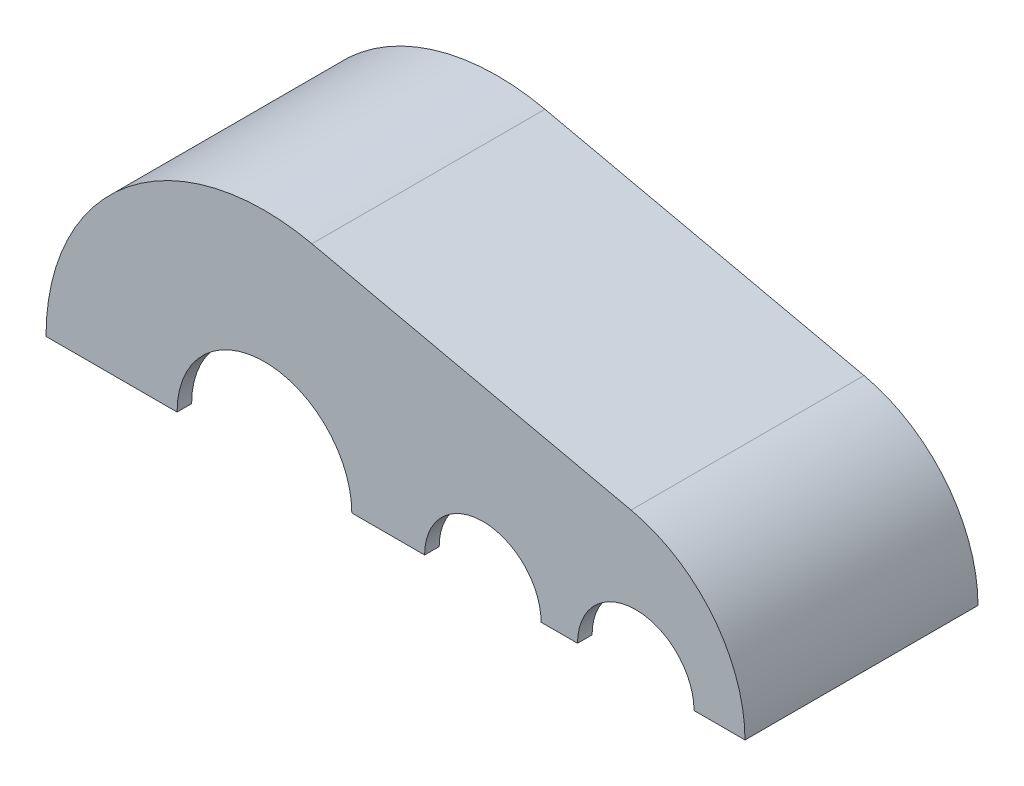
ISO-10303-21;
HEADER;
FILE_DESCRIPTION(('STEP AP214'),'2;1');
FILE_NAME('part.step','',(''),(''),'','','');
FILE_SCHEMA(('AUTOMOTIVE_DESIGN { 1 0 10303 214 1 1 1 1 }'));
ENDSEC;
DATA;
#1=APPLICATION_CONTEXT('core data for automotive mechanical design processes');
#2=APPLICATION_PROTOCOL_DEFINITION('international standard','automotive_design',2000,#1);
#3=PRODUCT_CONTEXT('',#1,'mechanical');
#4=PRODUCT('Part','Part','',(#3));
#5=PRODUCT_RELATED_PRODUCT_CATEGORY('part','',(#4));
#6=PRODUCT_DEFINITION_FORMATION('','',#4);
#7=PRODUCT_DEFINITION_CONTEXT('part definition',#1,'design');
#8=PRODUCT_DEFINITION('design','',#6,#7);
#9=PRODUCT_DEFINITION_SHAPE('','',#8);
#10=(LENGTH_UNIT() NAMED_UNIT(*) SI_UNIT(.MILLI.,.METRE.));
#11=(NAMED_UNIT(*) PLANE_ANGLE_UNIT() SI_UNIT($,.RADIAN.));
#12=(NAMED_UNIT(*) SI_UNIT($,.STERADIAN.) SOLID_ANGLE_UNIT());
#13=UNCERTAINTY_MEASURE_WITH_UNIT(LENGTH_MEASURE(1.E-05),#10,'distance_accuracy_value','');
#14=(GEOMETRIC_REPRESENTATION_CONTEXT(3) GLOBAL_UNCERTAINTY_ASSIGNED_CONTEXT((#13)) GLOBAL_UNIT_ASSIGNED_CONTEXT((#10,
#11,#12)) REPRESENTATION_CONTEXT('',''));
#15=CARTESIAN_POINT('',(0.,0.,0.));
#16=DIRECTION('',(0.,0.,1.));
#17=DIRECTION('',(1.,0.,0.));
#18=AXIS2_PLACEMENT_3D('',#15,#16,#17);
#19=CARTESIAN_POINT('',(0.,0.,0.));
#20=DIRECTION('',(0.,-1.,0.));
#21=DIRECTION('',(0.,0.,-1.));
#22=AXIS2_PLACEMENT_3D('',#19,#20,#21);
#23=PLANE('',#22);
#24=DIRECTION('',(0.,0.,1.));
#25=VECTOR('',#24,1.);
#26=CARTESIAN_POINT('',(20.,0.,-80.));
#27=LINE('',#26,#25);
#28=CARTESIAN_POINT('',(20.,0.,-70.));
#29=VERTEX_POINT('',#28);
#30=CARTESIAN_POINT('',(20.,0.,-80.));
#31=VERTEX_POINT('',#30);
#32=EDGE_CURVE('E309',#29,#31,#27,.F.);
#33=ORIENTED_EDGE('',*,*,#32,.F.);
#34=DIRECTION('',(-1.,0.,0.));
#35=VECTOR('',#34,1.);
#36=CARTESIAN_POINT('',(0.,0.,-70.));
#37=LINE('',#36,#35);
#38=CARTESIAN_POINT('',(-30.,0.,-70.));
#39=VERTEX_POINT('',#38);
#40=EDGE_CURVE('E214',#29,#39,#37,.T.);
#41=ORIENTED_EDGE('',*,*,#40,.T.);
#42=DIRECTION('',(0.,0.,1.));
#43=VECTOR('',#42,1.);
#44=CARTESIAN_POINT('',(-30.,0.,-80.));
#45=LINE('',#44,#43);
#46=CARTESIAN_POINT('',(-30.,0.,-80.));
#47=VERTEX_POINT('',#46);
#48=EDGE_CURVE('E12',#47,#39,#45,.T.);
#49=ORIENTED_EDGE('',*,*,#48,.F.);
#50=DIRECTION('',(-1.,0.,0.));
#51=VECTOR('',#50,1.);
#52=CARTESIAN_POINT('',(-240.,0.,-80.));
#53=LINE('',#52,#51);
#54=EDGE_CURVE('E332',#31,#47,#53,.T.);
#55=ORIENTED_EDGE('',*,*,#54,.F.);
#56=EDGE_LOOP('',(#33,#41,#49,#55));
#57=FACE_BOUND('',#56,.T.);
#58=ADVANCED_FACE('F43',(#57),#23,.T.);
#59=CARTESIAN_POINT('',(-30.,0.,70.));
#60=VERTEX_POINT('',#59);
#61=CARTESIAN_POINT('',(-30.,0.,80.));
#62=VERTEX_POINT('',#61);
#63=EDGE_CURVE('E51',#60,#62,#45,.T.);
#64=ORIENTED_EDGE('',*,*,#63,.F.);
#65=DIRECTION('',(1.,0.,0.));
#66=VECTOR('',#65,1.);
#67=CARTESIAN_POINT('',(0.,0.,70.));
#68=LINE('',#67,#66);
#69=CARTESIAN_POINT('',(20.,0.,70.));
#70=VERTEX_POINT('',#69);
#71=EDGE_CURVE('E240',#60,#70,#68,.T.);
#72=ORIENTED_EDGE('',*,*,#71,.T.);
#73=CARTESIAN_POINT('',(19.9999999999999,0.,80.));
#74=VERTEX_POINT('',#73);
#75=EDGE_CURVE('E310',#74,#70,#27,.F.);
#76=ORIENTED_EDGE('',*,*,#75,.F.);
#77=DIRECTION('',(1.,0.,0.));
#78=VECTOR('',#77,1.);
#79=CARTESIAN_POINT('',(-240.,0.,80.));
#80=LINE('',#79,#78);
#81=EDGE_CURVE('E302',#62,#74,#80,.T.);
#82=ORIENTED_EDGE('',*,*,#81,.F.);
#83=EDGE_LOOP('',(#64,#72,#76,#82));
#84=FACE_BOUND('',#83,.T.);
#85=ADVANCED_FACE('F373',(#84),#23,.T.);
#86=DIRECTION('',(0.,0.,1.));
#87=VECTOR('',#86,1.);
#88=CARTESIAN_POINT('',(125.,0.,-80.));
#89=LINE('',#88,#87);
#90=CARTESIAN_POINT('',(125.,0.,-70.));
#91=VERTEX_POINT('',#90);
#92=CARTESIAN_POINT('',(125.,0.,-80.));
#93=VERTEX_POINT('',#92);
#94=EDGE_CURVE('E301',#91,#93,#89,.F.);
#95=ORIENTED_EDGE('',*,*,#94,.F.);
#96=DIRECTION('',(-1.,0.,0.));
#97=VECTOR('',#96,1.);
#98=CARTESIAN_POINT('',(0.,0.,-70.));
#99=LINE('',#98,#97);
#100=CARTESIAN_POINT('',(100.,0.,-70.));
#101=VERTEX_POINT('',#100);
#102=EDGE_CURVE('E217',#91,#101,#99,.T.);
#103=ORIENTED_EDGE('',*,*,#102,.T.);
#104=DIRECTION('',(0.,0.,1.));
#105=VECTOR('',#104,1.);
#106=CARTESIAN_POINT('',(100.,0.,-80.));
#107=LINE('',#106,#105);
#108=CARTESIAN_POINT('',(100.,0.,-80.));
#109=VERTEX_POINT('',#108);
#110=EDGE_CURVE('E314',#109,#101,#107,.T.);
#111=ORIENTED_EDGE('',*,*,#110,.F.);
#112=EDGE_CURVE('E294',#93,#109,#53,.T.);
#113=ORIENTED_EDGE('',*,*,#112,.F.);
#114=EDGE_LOOP('',(#95,#103,#111,#113));
#115=FACE_BOUND('',#114,.T.);
#116=ADVANCED_FACE('F341',(#115),#23,.T.);
#117=CARTESIAN_POINT('',(100.,0.,70.));
#118=VERTEX_POINT('',#117);
#119=CARTESIAN_POINT('',(100.,0.,80.));
#120=VERTEX_POINT('',#119);
#121=EDGE_CURVE('E313',#118,#120,#107,.T.);
#122=ORIENTED_EDGE('',*,*,#121,.F.);
#123=DIRECTION('',(1.,0.,0.));
#124=VECTOR('',#123,1.);
#125=CARTESIAN_POINT('',(0.,0.,70.));
#126=LINE('',#125,#124);
#127=CARTESIAN_POINT('',(125.,0.,70.));
#128=VERTEX_POINT('',#127);
#129=EDGE_CURVE('E236',#118,#128,#126,.T.);
#130=ORIENTED_EDGE('',*,*,#129,.T.);
#131=CARTESIAN_POINT('',(125.,0.,80.));
#132=VERTEX_POINT('',#131);
#133=EDGE_CURVE('E303',#132,#128,#89,.F.);
#134=ORIENTED_EDGE('',*,*,#133,.F.);
#135=EDGE_CURVE('E362',#120,#132,#80,.T.);
#136=ORIENTED_EDGE('',*,*,#135,.F.);
#137=EDGE_LOOP('',(#122,#130,#134,#136));
#138=FACE_BOUND('',#137,.T.);
#139=ADVANCED_FACE('F379',(#138),#23,.T.);
#140=DIRECTION('',(0.,0.,1.));
#141=VECTOR('',#140,1.);
#142=CARTESIAN_POINT('',(230.,0.,70.));
#143=LINE('',#142,#141);
#144=CARTESIAN_POINT('',(230.,0.,70.));
#145=VERTEX_POINT('',#144);
#146=CARTESIAN_POINT('',(230.,0.,-70.));
#147=VERTEX_POINT('',#146);
#148=EDGE_CURVE('E190',#145,#147,#143,.F.);
#149=ORIENTED_EDGE('',*,*,#148,.T.);
#150=DIRECTION('',(-1.,0.,0.));
#151=VECTOR('',#150,1.);
#152=CARTESIAN_POINT('',(0.,0.,-70.));
#153=LINE('',#152,#151);
#154=CARTESIAN_POINT('',(205.,0.,-70.));
#155=VERTEX_POINT('',#154);
#156=EDGE_CURVE('E225',#147,#155,#153,.T.);
#157=ORIENTED_EDGE('',*,*,#156,.T.);
#158=DIRECTION('',(0.,0.,1.));
#159=VECTOR('',#158,1.);
#160=CARTESIAN_POINT('',(205.,0.,-80.));
#161=LINE('',#160,#159);
#162=CARTESIAN_POINT('',(205.,0.,-80.));
#163=VERTEX_POINT('',#162);
#164=EDGE_CURVE('E306',#163,#155,#161,.T.);
#165=ORIENTED_EDGE('',*,*,#164,.F.);
#166=CARTESIAN_POINT('',(240.,0.,-80.));
#167=VERTEX_POINT('',#166);
#168=EDGE_CURVE('E290',#167,#163,#53,.T.);
#169=ORIENTED_EDGE('',*,*,#168,.F.);
#170=DIRECTION('',(0.,0.,-1.));
#171=VECTOR('',#170,1.);
#172=CARTESIAN_POINT('',(240.,0.,80.));
#173=LINE('',#172,#171);
#174=CARTESIAN_POINT('',(240.,0.,80.));
#175=VERTEX_POINT('',#174);
#176=EDGE_CURVE('E286',#175,#167,#173,.T.);
#177=ORIENTED_EDGE('',*,*,#176,.F.);
#178=CARTESIAN_POINT('',(205.,0.,80.));
#179=VERTEX_POINT('',#178);
#180=EDGE_CURVE('E297',#179,#175,#80,.T.);
#181=ORIENTED_EDGE('',*,*,#180,.F.);
#182=CARTESIAN_POINT('',(205.,0.,70.));
#183=VERTEX_POINT('',#182);
#184=EDGE_CURVE('E305',#183,#179,#161,.T.);
#185=ORIENTED_EDGE('',*,*,#184,.F.);
#186=DIRECTION('',(1.,0.,0.));
#187=VECTOR('',#186,1.);
#188=CARTESIAN_POINT('',(0.,0.,70.));
#189=LINE('',#188,#187);
#190=EDGE_CURVE('E233',#183,#145,#189,.T.);
#191=ORIENTED_EDGE('',*,*,#190,.T.);
#192=EDGE_LOOP('',(#149,#157,#165,#169,#177,#181,#185,#191));
#193=FACE_BOUND('',#192,.T.);
#194=ADVANCED_FACE('F351',(#193),#23,.T.);
#195=DIRECTION('',(0.,0.,1.));
#196=VECTOR('',#195,1.);
#197=CARTESIAN_POINT('',(-230.,0.,-70.));
#198=LINE('',#197,#196);
#199=CARTESIAN_POINT('',(-230.,0.,-70.));
#200=VERTEX_POINT('',#199);
#201=CARTESIAN_POINT('',(-230.,0.,70.));
#202=VERTEX_POINT('',#201);
#203=EDGE_CURVE('E202',#200,#202,#198,.T.);
#204=ORIENTED_EDGE('',*,*,#203,.T.);
#205=DIRECTION('',(1.,0.,0.));
#206=VECTOR('',#205,1.);
#207=CARTESIAN_POINT('',(0.,0.,70.));
#208=LINE('',#207,#206);
#209=CARTESIAN_POINT('',(-150.,0.,70.));
#210=VERTEX_POINT('',#209);
#211=EDGE_CURVE('E245',#202,#210,#208,.T.);
#212=ORIENTED_EDGE('',*,*,#211,.T.);
#213=DIRECTION('',(0.,0.,1.));
#214=VECTOR('',#213,1.);
#215=CARTESIAN_POINT('',(-150.,0.,-80.));
#216=LINE('',#215,#214);
#217=CARTESIAN_POINT('',(-150.,0.,80.));
#218=VERTEX_POINT('',#217);
#219=EDGE_CURVE('E317',#218,#210,#216,.F.);
#220=ORIENTED_EDGE('',*,*,#219,.F.);
#221=CARTESIAN_POINT('',(-240.,0.,80.));
#222=VERTEX_POINT('',#221);
#223=EDGE_CURVE('E298',#222,#218,#80,.T.);
#224=ORIENTED_EDGE('',*,*,#223,.F.);
#225=DIRECTION('',(0.,0.,1.));
#226=VECTOR('',#225,1.);
#227=CARTESIAN_POINT('',(-240.,0.,80.));
#228=LINE('',#227,#226);
#229=CARTESIAN_POINT('',(-240.,0.,-80.));
#230=VERTEX_POINT('',#229);
#231=EDGE_CURVE('E293',#230,#222,#228,.T.);
#232=ORIENTED_EDGE('',*,*,#231,.F.);
#233=CARTESIAN_POINT('',(-150.,0.,-80.));
#234=VERTEX_POINT('',#233);
#235=EDGE_CURVE('E289',#234,#230,#53,.T.);
#236=ORIENTED_EDGE('',*,*,#235,.F.);
#237=CARTESIAN_POINT('',(-150.,0.,-70.));
#238=VERTEX_POINT('',#237);
#239=EDGE_CURVE('E316',#238,#234,#216,.F.);
#240=ORIENTED_EDGE('',*,*,#239,.F.);
#241=DIRECTION('',(-1.,0.,0.));
#242=VECTOR('',#241,1.);
#243=CARTESIAN_POINT('',(0.,0.,-70.));
#244=LINE('',#243,#242);
#245=EDGE_CURVE('E58',#238,#200,#244,.T.);
#246=ORIENTED_EDGE('',*,*,#245,.T.);
#247=EDGE_LOOP('',(#204,#212,#220,#224,#232,#236,#240,#246));
#248=FACE_BOUND('',#247,.T.);
#249=ADVANCED_FACE('F334',(#248),#23,.T.);
#250=CARTESIAN_POINT('',(165.,0.,-80.));
#251=DIRECTION('',(0.,0.,1.));
#252=DIRECTION('',(1.,0.,0.));
#253=AXIS2_PLACEMENT_3D('',#250,#251,#252);
#254=CYLINDRICAL_SURFACE('',#253,40.);
#255=CARTESIAN_POINT('',(165.,0.,70.));
#256=DIRECTION('',(0.,0.,-1.));
#257=DIRECTION('',(-1.,0.,0.));
#258=AXIS2_PLACEMENT_3D('',#255,#256,#257);
#259=CIRCLE('',#258,40.);
#260=EDGE_CURVE('E222',#183,#128,#259,.F.);
#261=ORIENTED_EDGE('',*,*,#260,.F.);
#262=ORIENTED_EDGE('',*,*,#184,.T.);
#263=CARTESIAN_POINT('',(165.,0.,80.));
#264=DIRECTION('',(0.,0.,1.));
#265=DIRECTION('',(1.,0.,0.));
#266=AXIS2_PLACEMENT_3D('',#263,#264,#265);
#267=CIRCLE('',#266,40.);
#268=EDGE_CURVE('E66',#179,#132,#267,.T.);
#269=ORIENTED_EDGE('',*,*,#268,.T.);
#270=ORIENTED_EDGE('',*,*,#133,.T.);
#271=EDGE_LOOP('',(#261,#262,#269,#270));
#272=FACE_BOUND('',#271,.T.);
#273=ADVANCED_FACE('F381',(#272),#254,.F.);
#274=CARTESIAN_POINT('',(60.,0.,-80.));
#275=DIRECTION('',(0.,0.,1.));
#276=DIRECTION('',(1.,0.,0.));
#277=AXIS2_PLACEMENT_3D('',#274,#275,#276);
#278=CYLINDRICAL_SURFACE('',#277,40.);
#279=CARTESIAN_POINT('',(60.,0.,70.));
#280=DIRECTION('',(0.,0.,-1.));
#281=DIRECTION('',(-1.,0.,0.));
#282=AXIS2_PLACEMENT_3D('',#279,#280,#281);
#283=CIRCLE('',#282,40.);
#284=EDGE_CURVE('E221',#118,#70,#283,.F.);
#285=ORIENTED_EDGE('',*,*,#284,.F.);
#286=ORIENTED_EDGE('',*,*,#121,.T.);
#287=CARTESIAN_POINT('',(60.,0.,80.));
#288=DIRECTION('',(0.,0.,1.));
#289=DIRECTION('',(1.,0.,0.));
#290=AXIS2_PLACEMENT_3D('',#287,#288,#289);
#291=CIRCLE('',#290,40.);
#292=EDGE_CURVE('E256',#120,#74,#291,.T.);
#293=ORIENTED_EDGE('',*,*,#292,.T.);
#294=ORIENTED_EDGE('',*,*,#75,.T.);
#295=EDGE_LOOP('',(#285,#286,#293,#294));
#296=FACE_BOUND('',#295,.T.);
#297=ADVANCED_FACE('F376',(#296),#278,.F.);
#298=CARTESIAN_POINT('',(-90.,0.,-80.));
#299=DIRECTION('',(0.,0.,1.));
#300=DIRECTION('',(1.,0.,0.));
#301=AXIS2_PLACEMENT_3D('',#298,#299,#300);
#302=CYLINDRICAL_SURFACE('',#301,60.);
#303=CARTESIAN_POINT('',(-90.,0.,70.));
#304=DIRECTION('',(0.,0.,-1.));
#305=DIRECTION('',(-1.,0.,0.));
#306=AXIS2_PLACEMENT_3D('',#303,#304,#305);
#307=CIRCLE('',#306,60.);
#308=EDGE_CURVE('E242',#60,#210,#307,.F.);
#309=ORIENTED_EDGE('',*,*,#308,.F.);
#310=ORIENTED_EDGE('',*,*,#63,.T.);
#311=CARTESIAN_POINT('',(-90.,0.,80.));
#312=DIRECTION('',(0.,0.,1.));
#313=DIRECTION('',(1.,0.,0.));
#314=AXIS2_PLACEMENT_3D('',#311,#312,#313);
#315=CIRCLE('',#314,60.);
#316=EDGE_CURVE('E253',#62,#218,#315,.T.);
#317=ORIENTED_EDGE('',*,*,#316,.T.);
#318=ORIENTED_EDGE('',*,*,#219,.T.);
#319=EDGE_LOOP('',(#309,#310,#317,#318));
#320=FACE_BOUND('',#319,.T.);
#321=ADVANCED_FACE('F448',(#320),#302,.F.);
#322=CARTESIAN_POINT('',(-240.,150.,-80.));
#323=DIRECTION('',(0.,0.,1.));
#324=DIRECTION('',(1.,0.,0.));
#325=AXIS2_PLACEMENT_3D('',#322,#323,#324);
#326=PLANE('',#325);
#327=ORIENTED_EDGE('',*,*,#54,.T.);
#328=CARTESIAN_POINT('',(-90.,0.,-80.));
#329=DIRECTION('',(0.,0.,1.));
#330=DIRECTION('',(1.,0.,0.));
#331=AXIS2_PLACEMENT_3D('',#328,#329,#330);
#332=CIRCLE('',#331,60.);
#333=EDGE_CURVE('E255',#47,#234,#332,.T.);
#334=ORIENTED_EDGE('',*,*,#333,.T.);
#335=ORIENTED_EDGE('',*,*,#235,.T.);
#336=CARTESIAN_POINT('',(-90.,0.,-80.));
#337=DIRECTION('',(0.,0.,1.));
#338=DIRECTION('',(1.,0.,0.));
#339=AXIS2_PLACEMENT_3D('',#336,#337,#338);
#340=CIRCLE('',#339,150.);
#341=CARTESIAN_POINT('',(-57.391304347826,146.412680352024,-80.));
#342=VERTEX_POINT('',#341);
#343=EDGE_CURVE('E274',#342,#230,#340,.T.);
#344=ORIENTED_EDGE('',*,*,#343,.F.);
#345=DIRECTION('',(-0.976084535680159,0.217391304347826,0.));
#346=VECTOR('',#345,1.);
#347=CARTESIAN_POINT('',(-57.391304347826,146.412680352024,-80.));
#348=LINE('',#347,#346);
#349=CARTESIAN_POINT('',(161.739130434783,97.6084535680159,-80.));
#350=VERTEX_POINT('',#349);
#351=EDGE_CURVE('E280',#350,#342,#348,.T.);
#352=ORIENTED_EDGE('',*,*,#351,.F.);
#353=CARTESIAN_POINT('',(140.,0.,-80.));
#354=DIRECTION('',(0.,0.,1.));
#355=DIRECTION('',(1.,0.,0.));
#356=AXIS2_PLACEMENT_3D('',#353,#354,#355);
#357=CIRCLE('',#356,100.);
#358=EDGE_CURVE('E277',#167,#350,#357,.T.);
#359=ORIENTED_EDGE('',*,*,#358,.F.);
#360=ORIENTED_EDGE('',*,*,#168,.T.);
#361=CARTESIAN_POINT('',(165.,0.,-80.));
#362=DIRECTION('',(0.,0.,1.));
#363=DIRECTION('',(1.,0.,0.));
#364=AXIS2_PLACEMENT_3D('',#361,#362,#363);
#365=CIRCLE('',#364,40.);
#366=EDGE_CURVE('E249',#163,#93,#365,.T.);
#367=ORIENTED_EDGE('',*,*,#366,.T.);
#368=ORIENTED_EDGE('',*,*,#112,.T.);
#369=CARTESIAN_POINT('',(60.,0.,-80.));
#370=DIRECTION('',(0.,0.,1.));
#371=DIRECTION('',(1.,0.,0.));
#372=AXIS2_PLACEMENT_3D('',#369,#370,#371);
#373=CIRCLE('',#372,40.);
#374=EDGE_CURVE('E260',#109,#31,#373,.T.);
#375=ORIENTED_EDGE('',*,*,#374,.T.);
#376=EDGE_LOOP('',(#327,#334,#335,#344,#352,#359,#360,#367,#368,#375));
#377=FACE_BOUND('',#376,.T.);
#378=ADVANCED_FACE('F45',(#377),#326,.F.);
#379=CARTESIAN_POINT('',(-240.,150.,80.));
#380=DIRECTION('',(0.,0.,-1.));
#381=DIRECTION('',(-1.,0.,0.));
#382=AXIS2_PLACEMENT_3D('',#379,#380,#381);
#383=PLANE('',#382);
#384=ORIENTED_EDGE('',*,*,#223,.T.);
#385=ORIENTED_EDGE('',*,*,#316,.F.);
#386=ORIENTED_EDGE('',*,*,#81,.T.);
#387=ORIENTED_EDGE('',*,*,#292,.F.);
#388=ORIENTED_EDGE('',*,*,#135,.T.);
#389=ORIENTED_EDGE('',*,*,#268,.F.);
#390=ORIENTED_EDGE('',*,*,#180,.T.);
#391=CARTESIAN_POINT('',(140.,0.,80.));
#392=DIRECTION('',(0.,0.,1.));
#393=DIRECTION('',(1.,0.,0.));
#394=AXIS2_PLACEMENT_3D('',#391,#392,#393);
#395=CIRCLE('',#394,100.);
#396=CARTESIAN_POINT('',(161.739130434783,97.6084535680159,80.));
#397=VERTEX_POINT('',#396);
#398=EDGE_CURVE('E268',#175,#397,#395,.T.);
#399=ORIENTED_EDGE('',*,*,#398,.T.);
#400=DIRECTION('',(-0.976084535680159,0.217391304347826,0.));
#401=VECTOR('',#400,1.);
#402=CARTESIAN_POINT('',(-57.391304347826,146.412680352024,80.));
#403=LINE('',#402,#401);
#404=CARTESIAN_POINT('',(-57.391304347826,146.412680352024,80.));
#405=VERTEX_POINT('',#404);
#406=EDGE_CURVE('E271',#397,#405,#403,.T.);
#407=ORIENTED_EDGE('',*,*,#406,.T.);
#408=CARTESIAN_POINT('',(-90.,0.,80.));
#409=DIRECTION('',(0.,0.,1.));
#410=DIRECTION('',(1.,0.,0.));
#411=AXIS2_PLACEMENT_3D('',#408,#409,#410);
#412=CIRCLE('',#411,150.);
#413=EDGE_CURVE('E259',#405,#222,#412,.T.);
#414=ORIENTED_EDGE('',*,*,#413,.T.);
#415=EDGE_LOOP('',(#384,#385,#386,#387,#388,#389,#390,#399,#407,#414));
#416=FACE_BOUND('',#415,.T.);
#417=ADVANCED_FACE('F369',(#416),#383,.F.);
#418=CARTESIAN_POINT('',(-90.,0.,-80.));
#419=DIRECTION('',(0.,0.,1.));
#420=DIRECTION('',(1.,0.,0.));
#421=AXIS2_PLACEMENT_3D('',#418,#419,#420);
#422=CYLINDRICAL_SURFACE('',#421,150.);
#423=ORIENTED_EDGE('',*,*,#343,.T.);
#424=ORIENTED_EDGE('',*,*,#231,.T.);
#425=ORIENTED_EDGE('',*,*,#413,.F.);
#426=DIRECTION('',(0.,0.,1.));
#427=VECTOR('',#426,1.);
#428=CARTESIAN_POINT('',(-57.391304347826,146.412680352024,-80.));
#429=LINE('',#428,#427);
#430=EDGE_CURVE('E284',#342,#405,#429,.T.);
#431=ORIENTED_EDGE('',*,*,#430,.F.);
#432=EDGE_LOOP('',(#423,#424,#425,#431));
#433=FACE_BOUND('',#432,.T.);
#434=ADVANCED_FACE('F390',(#433),#422,.T.);
#435=CARTESIAN_POINT('',(-57.391304347826,146.412680352024,-80.));
#436=DIRECTION('',(0.217391304347826,0.976084535680159,0.));
#437=DIRECTION('',(-0.976084535680159,0.217391304347826,0.));
#438=AXIS2_PLACEMENT_3D('',#435,#436,#437);
#439=PLANE('',#438);
#440=DIRECTION('',(0.,0.,1.));
#441=VECTOR('',#440,1.);
#442=CARTESIAN_POINT('',(161.739130434783,97.6084535680159,-80.));
#443=LINE('',#442,#441);
#444=EDGE_CURVE('E283',#350,#397,#443,.T.);
#445=ORIENTED_EDGE('',*,*,#444,.F.);
#446=ORIENTED_EDGE('',*,*,#351,.T.);
#447=ORIENTED_EDGE('',*,*,#430,.T.);
#448=ORIENTED_EDGE('',*,*,#406,.F.);
#449=EDGE_LOOP('',(#445,#446,#447,#448));
#450=FACE_BOUND('',#449,.T.);
#451=ADVANCED_FACE('F392',(#450),#439,.T.);
#452=CARTESIAN_POINT('',(140.,0.,-80.));
#453=DIRECTION('',(0.,0.,1.));
#454=DIRECTION('',(1.,0.,0.));
#455=AXIS2_PLACEMENT_3D('',#452,#453,#454);
#456=CYLINDRICAL_SURFACE('',#455,100.);
#457=ORIENTED_EDGE('',*,*,#176,.T.);
#458=ORIENTED_EDGE('',*,*,#358,.T.);
#459=ORIENTED_EDGE('',*,*,#444,.T.);
#460=ORIENTED_EDGE('',*,*,#398,.F.);
#461=EDGE_LOOP('',(#457,#458,#459,#460));
#462=FACE_BOUND('',#461,.T.);
#463=ADVANCED_FACE('F356',(#462),#456,.T.);
#464=ORIENTED_EDGE('',*,*,#164,.T.);
#465=CARTESIAN_POINT('',(165.,0.,-70.));
#466=DIRECTION('',(0.,0.,1.));
#467=DIRECTION('',(1.,0.,0.));
#468=AXIS2_PLACEMENT_3D('',#465,#466,#467);
#469=CIRCLE('',#468,40.);
#470=EDGE_CURVE('E226',#155,#91,#469,.T.);
#471=ORIENTED_EDGE('',*,*,#470,.T.);
#472=ORIENTED_EDGE('',*,*,#94,.T.);
#473=ORIENTED_EDGE('',*,*,#366,.F.);
#474=EDGE_LOOP('',(#464,#471,#472,#473));
#475=FACE_BOUND('',#474,.T.);
#476=ADVANCED_FACE('F347',(#475),#254,.F.);
#477=ORIENTED_EDGE('',*,*,#110,.T.);
#478=CARTESIAN_POINT('',(60.,0.,-70.));
#479=DIRECTION('',(0.,0.,1.));
#480=DIRECTION('',(1.,0.,0.));
#481=AXIS2_PLACEMENT_3D('',#478,#479,#480);
#482=CIRCLE('',#481,40.);
#483=EDGE_CURVE('E218',#101,#29,#482,.T.);
#484=ORIENTED_EDGE('',*,*,#483,.T.);
#485=ORIENTED_EDGE('',*,*,#32,.T.);
#486=ORIENTED_EDGE('',*,*,#374,.F.);
#487=EDGE_LOOP('',(#477,#484,#485,#486));
#488=FACE_BOUND('',#487,.T.);
#489=ADVANCED_FACE('F343',(#488),#278,.F.);
#490=ORIENTED_EDGE('',*,*,#48,.T.);
#491=CARTESIAN_POINT('',(-90.,0.,-70.));
#492=DIRECTION('',(0.,0.,1.));
#493=DIRECTION('',(1.,0.,0.));
#494=AXIS2_PLACEMENT_3D('',#491,#492,#493);
#495=CIRCLE('',#494,60.);
#496=EDGE_CURVE('E209',#39,#238,#495,.T.);
#497=ORIENTED_EDGE('',*,*,#496,.T.);
#498=ORIENTED_EDGE('',*,*,#239,.T.);
#499=ORIENTED_EDGE('',*,*,#333,.F.);
#500=EDGE_LOOP('',(#490,#497,#498,#499));
#501=FACE_BOUND('',#500,.T.);
#502=ADVANCED_FACE('F324',(#501),#302,.F.);
#503=CARTESIAN_POINT('',(-240.,150.,-70.));
#504=DIRECTION('',(0.,0.,1.));
#505=DIRECTION('',(1.,0.,0.));
#506=AXIS2_PLACEMENT_3D('',#503,#504,#505);
#507=PLANE('',#506);
#508=ORIENTED_EDGE('',*,*,#40,.F.);
#509=ORIENTED_EDGE('',*,*,#483,.F.);
#510=ORIENTED_EDGE('',*,*,#102,.F.);
#511=ORIENTED_EDGE('',*,*,#470,.F.);
#512=ORIENTED_EDGE('',*,*,#156,.F.);
#513=CARTESIAN_POINT('',(140.,0.,-70.));
#514=DIRECTION('',(0.,0.,1.));
#515=DIRECTION('',(1.,0.,0.));
#516=AXIS2_PLACEMENT_3D('',#513,#514,#515);
#517=CIRCLE('',#516,90.);
#518=CARTESIAN_POINT('',(159.565217391304,87.8476082112143,-70.));
#519=VERTEX_POINT('',#518);
#520=EDGE_CURVE('E198',#147,#519,#517,.T.);
#521=ORIENTED_EDGE('',*,*,#520,.T.);
#522=DIRECTION('',(-0.976084535680159,0.217391304347826,0.));
#523=VECTOR('',#522,1.);
#524=CARTESIAN_POINT('',(-234.305214065185,175.569525430918,-70.));
#525=LINE('',#524,#523);
#526=CARTESIAN_POINT('',(-59.5652173913043,136.651834995222,-70.));
#527=VERTEX_POINT('',#526);
#528=EDGE_CURVE('E184',#519,#527,#525,.T.);
#529=ORIENTED_EDGE('',*,*,#528,.T.);
#530=CARTESIAN_POINT('',(-90.,0.,-70.));
#531=DIRECTION('',(0.,0.,1.));
#532=DIRECTION('',(1.,0.,0.));
#533=AXIS2_PLACEMENT_3D('',#530,#531,#532);
#534=CIRCLE('',#533,140.);
#535=EDGE_CURVE('E195',#527,#200,#534,.T.);
#536=ORIENTED_EDGE('',*,*,#535,.T.);
#537=ORIENTED_EDGE('',*,*,#245,.F.);
#538=ORIENTED_EDGE('',*,*,#496,.F.);
#539=EDGE_LOOP('',(#508,#509,#510,#511,#512,#521,#529,#536,#537,#538));
#540=FACE_BOUND('',#539,.T.);
#541=ADVANCED_FACE('F194',(#540),#507,.T.);
#542=CARTESIAN_POINT('',(-240.,150.,70.));
#543=DIRECTION('',(0.,0.,-1.));
#544=DIRECTION('',(-1.,0.,0.));
#545=AXIS2_PLACEMENT_3D('',#542,#543,#544);
#546=PLANE('',#545);
#547=ORIENTED_EDGE('',*,*,#211,.F.);
#548=CARTESIAN_POINT('',(-90.,0.,70.));
#549=DIRECTION('',(0.,0.,-1.));
#550=DIRECTION('',(-1.,0.,0.));
#551=AXIS2_PLACEMENT_3D('',#548,#549,#550);
#552=CIRCLE('',#551,140.);
#553=CARTESIAN_POINT('',(-59.5652173913043,136.651834995222,70.));
#554=VERTEX_POINT('',#553);
#555=EDGE_CURVE('E208',#554,#202,#552,.F.);
#556=ORIENTED_EDGE('',*,*,#555,.F.);
#557=DIRECTION('',(-0.976084535680159,0.217391304347826,0.));
#558=VECTOR('',#557,1.);
#559=CARTESIAN_POINT('',(-59.5652173913043,136.651834995222,70.));
#560=LINE('',#559,#558);
#561=CARTESIAN_POINT('',(159.565217391304,87.8476082112143,70.));
#562=VERTEX_POINT('',#561);
#563=EDGE_CURVE('E186',#562,#554,#560,.T.);
#564=ORIENTED_EDGE('',*,*,#563,.F.);
#565=CARTESIAN_POINT('',(140.,0.,70.));
#566=DIRECTION('',(0.,0.,-1.));
#567=DIRECTION('',(-1.,0.,0.));
#568=AXIS2_PLACEMENT_3D('',#565,#566,#567);
#569=CIRCLE('',#568,90.);
#570=EDGE_CURVE('E205',#145,#562,#569,.F.);
#571=ORIENTED_EDGE('',*,*,#570,.F.);
#572=ORIENTED_EDGE('',*,*,#190,.F.);
#573=ORIENTED_EDGE('',*,*,#260,.T.);
#574=ORIENTED_EDGE('',*,*,#129,.F.);
#575=ORIENTED_EDGE('',*,*,#284,.T.);
#576=ORIENTED_EDGE('',*,*,#71,.F.);
#577=ORIENTED_EDGE('',*,*,#308,.T.);
#578=EDGE_LOOP('',(#547,#556,#564,#571,#572,#573,#574,#575,#576,#577));
#579=FACE_BOUND('',#578,.T.);
#580=ADVANCED_FACE('F384',(#579),#546,.T.);
#581=CARTESIAN_POINT('',(-90.,0.,-80.));
#582=DIRECTION('',(0.,0.,1.));
#583=DIRECTION('',(1.,0.,0.));
#584=AXIS2_PLACEMENT_3D('',#581,#582,#583);
#585=CYLINDRICAL_SURFACE('',#584,140.);
#586=ORIENTED_EDGE('',*,*,#535,.F.);
#587=DIRECTION('',(0.,0.,1.));
#588=VECTOR('',#587,1.);
#589=CARTESIAN_POINT('',(-59.5652173913043,136.651834995222,-80.));
#590=LINE('',#589,#588);
#591=EDGE_CURVE('E181',#527,#554,#590,.T.);
#592=ORIENTED_EDGE('',*,*,#591,.T.);
#593=ORIENTED_EDGE('',*,*,#555,.T.);
#594=ORIENTED_EDGE('',*,*,#203,.F.);
#595=EDGE_LOOP('',(#586,#592,#593,#594));
#596=FACE_BOUND('',#595,.T.);
#597=ADVANCED_FACE('F200',(#596),#585,.F.);
#598=CARTESIAN_POINT('',(-59.5652173913043,136.651834995222,-80.));
#599=DIRECTION('',(0.217391304347826,0.976084535680159,0.));
#600=DIRECTION('',(-0.976084535680159,0.217391304347826,0.));
#601=AXIS2_PLACEMENT_3D('',#598,#599,#600);
#602=PLANE('',#601);
#603=DIRECTION('',(0.,0.,1.));
#604=VECTOR('',#603,1.);
#605=CARTESIAN_POINT('',(159.565217391304,87.8476082112143,-80.));
#606=LINE('',#605,#604);
#607=EDGE_CURVE('E191',#519,#562,#606,.T.);
#608=ORIENTED_EDGE('',*,*,#607,.T.);
#609=ORIENTED_EDGE('',*,*,#563,.T.);
#610=ORIENTED_EDGE('',*,*,#591,.F.);
#611=ORIENTED_EDGE('',*,*,#528,.F.);
#612=EDGE_LOOP('',(#608,#609,#610,#611));
#613=FACE_BOUND('',#612,.T.);
#614=ADVANCED_FACE('F183',(#613),#602,.F.);
#615=CARTESIAN_POINT('',(140.,0.,-80.));
#616=DIRECTION('',(0.,0.,1.));
#617=DIRECTION('',(1.,0.,0.));
#618=AXIS2_PLACEMENT_3D('',#615,#616,#617);
#619=CYLINDRICAL_SURFACE('',#618,90.);
#620=ORIENTED_EDGE('',*,*,#148,.F.);
#621=ORIENTED_EDGE('',*,*,#570,.T.);
#622=ORIENTED_EDGE('',*,*,#607,.F.);
#623=ORIENTED_EDGE('',*,*,#520,.F.);
#624=EDGE_LOOP('',(#620,#621,#622,#623));
#625=FACE_BOUND('',#624,.T.);
#626=ADVANCED_FACE('F387',(#625),#619,.F.);
#627=CLOSED_SHELL('',(#58,#85,#116,#139,#194,#249,#273,#297,#321,#378,#417,#434,#451,#463,#476,
#489,#502,#541,#580,#597,#614,#626));
#628=MANIFOLD_SOLID_BREP('B2',#627);
#629=ADVANCED_BREP_SHAPE_REPRESENTATION('',(#18,#628),#14);
#630=SHAPE_DEFINITION_REPRESENTATION(#9,#629);
ENDSEC;
END-ISO-10303-21;
